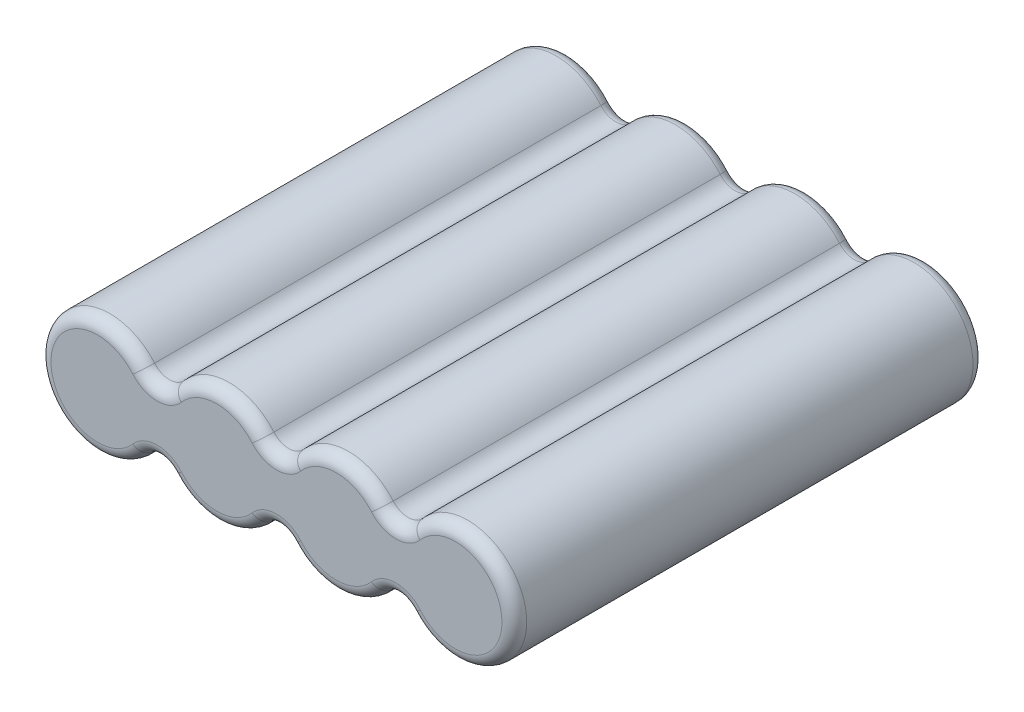
ISO-10303-21;
HEADER;
FILE_DESCRIPTION(('STEP AP214'),'2;1');
FILE_NAME('part.step','',(''),(''),'','','');
FILE_SCHEMA(('AUTOMOTIVE_DESIGN { 1 0 10303 214 1 1 1 1 }'));
ENDSEC;
DATA;
#1=APPLICATION_CONTEXT('core data for automotive mechanical design processes');
#2=APPLICATION_PROTOCOL_DEFINITION('international standard','automotive_design',2000,#1);
#3=PRODUCT_CONTEXT('',#1,'mechanical');
#4=PRODUCT('Part','Part','',(#3));
#5=PRODUCT_RELATED_PRODUCT_CATEGORY('part','',(#4));
#6=PRODUCT_DEFINITION_FORMATION('','',#4);
#7=PRODUCT_DEFINITION_CONTEXT('part definition',#1,'design');
#8=PRODUCT_DEFINITION('design','',#6,#7);
#9=PRODUCT_DEFINITION_SHAPE('','',#8);
#10=(LENGTH_UNIT() NAMED_UNIT(*) SI_UNIT(.MILLI.,.METRE.));
#11=(NAMED_UNIT(*) PLANE_ANGLE_UNIT() SI_UNIT($,.RADIAN.));
#12=(NAMED_UNIT(*) SI_UNIT($,.STERADIAN.) SOLID_ANGLE_UNIT());
#13=UNCERTAINTY_MEASURE_WITH_UNIT(LENGTH_MEASURE(1.E-05),#10,'distance_accuracy_value','');
#14=(GEOMETRIC_REPRESENTATION_CONTEXT(3) GLOBAL_UNCERTAINTY_ASSIGNED_CONTEXT((#13)) GLOBAL_UNIT_ASSIGNED_CONTEXT((#10,
#11,#12)) REPRESENTATION_CONTEXT('',''));
#15=CARTESIAN_POINT('',(0.,0.,0.));
#16=DIRECTION('',(0.,0.,1.));
#17=DIRECTION('',(1.,0.,0.));
#18=AXIS2_PLACEMENT_3D('',#15,#16,#17);
#19=CARTESIAN_POINT('',(9.652,0.,38.1));
#20=DIRECTION('',(0.,0.,-1.));
#21=DIRECTION('',(-1.,0.,0.));
#22=AXIS2_PLACEMENT_3D('',#19,#20,#21);
#23=CYLINDRICAL_SURFACE('',#22,4.7625);
#24=DIRECTION('',(0.,0.,-1.));
#25=VECTOR('',#24,1.);
#26=CARTESIAN_POINT('',(6.0325,3.0952586321663,38.1));
#27=LINE('',#26,#25);
#28=CARTESIAN_POINT('',(6.0325,3.0952586321663,37.1));
#29=VERTEX_POINT('',#28);
#30=CARTESIAN_POINT('',(6.0325,3.0952586321663,1.00000000000001));
#31=VERTEX_POINT('',#30);
#32=EDGE_CURVE('E228',#29,#31,#27,.T.);
#33=ORIENTED_EDGE('',*,*,#32,.F.);
#34=CARTESIAN_POINT('',(9.652,0.,37.1));
#35=DIRECTION('',(0.,0.,1.));
#36=DIRECTION('',(1.,0.,0.));
#37=AXIS2_PLACEMENT_3D('',#34,#35,#36);
#38=CIRCLE('',#37,4.7625);
#39=CARTESIAN_POINT('',(13.2715,3.0952586321663,37.1));
#40=VERTEX_POINT('',#39);
#41=EDGE_CURVE('E245',#29,#40,#38,.F.);
#42=ORIENTED_EDGE('',*,*,#41,.T.);
#43=DIRECTION('',(0.,0.,-1.));
#44=VECTOR('',#43,1.);
#45=CARTESIAN_POINT('',(13.2715,3.0952586321663,38.1));
#46=LINE('',#45,#44);
#47=CARTESIAN_POINT('',(13.2715,3.0952586321663,1.00000000000002));
#48=VERTEX_POINT('',#47);
#49=EDGE_CURVE('E336',#40,#48,#46,.T.);
#50=ORIENTED_EDGE('',*,*,#49,.T.);
#51=CARTESIAN_POINT('',(9.652,0.,0.999999999999994));
#52=DIRECTION('',(0.,0.,1.));
#53=DIRECTION('',(1.,0.,0.));
#54=AXIS2_PLACEMENT_3D('',#51,#52,#53);
#55=CIRCLE('',#54,4.7625);
#56=EDGE_CURVE('E243',#48,#31,#55,.T.);
#57=ORIENTED_EDGE('',*,*,#56,.T.);
#58=EDGE_LOOP('',(#33,#42,#50,#57));
#59=FACE_BOUND('',#58,.T.);
#60=ADVANCED_FACE('F44',(#59),#23,.T.);
#61=CARTESIAN_POINT('',(4.826,4.12701150955507,38.1));
#62=DIRECTION('',(0.,0.,-1.));
#63=DIRECTION('',(-1.,0.,0.));
#64=AXIS2_PLACEMENT_3D('',#61,#62,#63);
#65=CYLINDRICAL_SURFACE('',#64,1.5875);
#66=DIRECTION('',(0.,0.,-1.));
#67=VECTOR('',#66,1.);
#68=CARTESIAN_POINT('',(3.6195,3.0952586321663,38.1));
#69=LINE('',#68,#67);
#70=CARTESIAN_POINT('',(3.6195,3.0952586321663,37.1));
#71=VERTEX_POINT('',#70);
#72=CARTESIAN_POINT('',(3.6195,3.0952586321663,1.00000000000001));
#73=VERTEX_POINT('',#72);
#74=EDGE_CURVE('E431',#71,#73,#69,.T.);
#75=ORIENTED_EDGE('',*,*,#74,.F.);
#76=CARTESIAN_POINT('',(4.826,4.12701150955507,37.1));
#77=DIRECTION('',(0.,0.,1.));
#78=DIRECTION('',(1.,0.,0.));
#79=AXIS2_PLACEMENT_3D('',#76,#77,#78);
#80=CIRCLE('',#79,1.5875);
#81=EDGE_CURVE('E215',#71,#29,#80,.T.);
#82=ORIENTED_EDGE('',*,*,#81,.T.);
#83=ORIENTED_EDGE('',*,*,#32,.T.);
#84=CARTESIAN_POINT('',(4.826,4.12701150955507,1.00000000000001));
#85=DIRECTION('',(0.,0.,1.));
#86=DIRECTION('',(1.,0.,0.));
#87=AXIS2_PLACEMENT_3D('',#84,#85,#86);
#88=CIRCLE('',#87,1.5875);
#89=EDGE_CURVE('E234',#31,#73,#88,.F.);
#90=ORIENTED_EDGE('',*,*,#89,.T.);
#91=EDGE_LOOP('',(#75,#82,#83,#90));
#92=FACE_BOUND('',#91,.T.);
#93=ADVANCED_FACE('F463',(#92),#65,.F.);
#94=CARTESIAN_POINT('',(0.,0.,38.1));
#95=DIRECTION('',(0.,0.,-1.));
#96=DIRECTION('',(-1.,0.,0.));
#97=AXIS2_PLACEMENT_3D('',#94,#95,#96);
#98=CYLINDRICAL_SURFACE('',#97,4.7625);
#99=DIRECTION('',(0.,0.,-1.));
#100=VECTOR('',#99,1.);
#101=CARTESIAN_POINT('',(3.6195,-3.0952586321663,38.1));
#102=LINE('',#101,#100);
#103=CARTESIAN_POINT('',(3.6195,-3.0952586321663,37.1));
#104=VERTEX_POINT('',#103);
#105=CARTESIAN_POINT('',(3.6195,-3.0952586321663,1.00000000000001));
#106=VERTEX_POINT('',#105);
#107=EDGE_CURVE('E428',#104,#106,#102,.T.);
#108=ORIENTED_EDGE('',*,*,#107,.F.);
#109=CARTESIAN_POINT('',(0.,0.,37.1));
#110=DIRECTION('',(0.,0.,1.));
#111=DIRECTION('',(1.,0.,0.));
#112=AXIS2_PLACEMENT_3D('',#109,#110,#111);
#113=CIRCLE('',#112,4.7625);
#114=EDGE_CURVE('E13',#104,#71,#113,.F.);
#115=ORIENTED_EDGE('',*,*,#114,.T.);
#116=ORIENTED_EDGE('',*,*,#74,.T.);
#117=CARTESIAN_POINT('',(0.,0.,0.999999999999994));
#118=DIRECTION('',(0.,0.,1.));
#119=DIRECTION('',(1.,0.,0.));
#120=AXIS2_PLACEMENT_3D('',#117,#118,#119);
#121=CIRCLE('',#120,4.7625);
#122=EDGE_CURVE('E53',#73,#106,#121,.T.);
#123=ORIENTED_EDGE('',*,*,#122,.T.);
#124=EDGE_LOOP('',(#108,#115,#116,#123));
#125=FACE_BOUND('',#124,.T.);
#126=ADVANCED_FACE('F473',(#125),#98,.T.);
#127=CARTESIAN_POINT('',(4.826,-4.12701150955507,38.1));
#128=DIRECTION('',(0.,0.,-1.));
#129=DIRECTION('',(-1.,0.,0.));
#130=AXIS2_PLACEMENT_3D('',#127,#128,#129);
#131=CYLINDRICAL_SURFACE('',#130,1.5875);
#132=DIRECTION('',(0.,0.,-1.));
#133=VECTOR('',#132,1.);
#134=CARTESIAN_POINT('',(6.0325,-3.0952586321663,38.1));
#135=LINE('',#134,#133);
#136=CARTESIAN_POINT('',(6.0325,-3.0952586321663,37.1));
#137=VERTEX_POINT('',#136);
#138=CARTESIAN_POINT('',(6.0325,-3.0952586321663,1.00000000000002));
#139=VERTEX_POINT('',#138);
#140=EDGE_CURVE('E425',#137,#139,#135,.T.);
#141=ORIENTED_EDGE('',*,*,#140,.F.);
#142=CARTESIAN_POINT('',(4.826,-4.12701150955507,37.1));
#143=DIRECTION('',(0.,0.,1.));
#144=DIRECTION('',(1.,0.,0.));
#145=AXIS2_PLACEMENT_3D('',#142,#143,#144);
#146=CIRCLE('',#145,1.5875);
#147=EDGE_CURVE('E281',#137,#104,#146,.T.);
#148=ORIENTED_EDGE('',*,*,#147,.T.);
#149=ORIENTED_EDGE('',*,*,#107,.T.);
#150=CARTESIAN_POINT('',(4.826,-4.12701150955507,1.00000000000001));
#151=DIRECTION('',(0.,0.,1.));
#152=DIRECTION('',(1.,0.,0.));
#153=AXIS2_PLACEMENT_3D('',#150,#151,#152);
#154=CIRCLE('',#153,1.5875);
#155=EDGE_CURVE('E279',#106,#139,#154,.F.);
#156=ORIENTED_EDGE('',*,*,#155,.T.);
#157=EDGE_LOOP('',(#141,#148,#149,#156));
#158=FACE_BOUND('',#157,.T.);
#159=ADVANCED_FACE('F609',(#158),#131,.F.);
#160=CARTESIAN_POINT('',(9.652,0.,38.1));
#161=DIRECTION('',(0.,0.,-1.));
#162=DIRECTION('',(-1.,0.,0.));
#163=AXIS2_PLACEMENT_3D('',#160,#161,#162);
#164=CYLINDRICAL_SURFACE('',#163,4.7625);
#165=DIRECTION('',(0.,0.,-1.));
#166=VECTOR('',#165,1.);
#167=CARTESIAN_POINT('',(13.2715,-3.0952586321663,38.1));
#168=LINE('',#167,#166);
#169=CARTESIAN_POINT('',(13.2715,-3.0952586321663,37.1));
#170=VERTEX_POINT('',#169);
#171=CARTESIAN_POINT('',(13.2715,-3.0952586321663,1.00000000000001));
#172=VERTEX_POINT('',#171);
#173=EDGE_CURVE('E422',#170,#172,#168,.T.);
#174=ORIENTED_EDGE('',*,*,#173,.F.);
#175=CARTESIAN_POINT('',(9.652,0.,37.1));
#176=DIRECTION('',(0.,0.,1.));
#177=DIRECTION('',(1.,0.,0.));
#178=AXIS2_PLACEMENT_3D('',#175,#176,#177);
#179=CIRCLE('',#178,4.7625);
#180=EDGE_CURVE('E277',#170,#137,#179,.F.);
#181=ORIENTED_EDGE('',*,*,#180,.T.);
#182=ORIENTED_EDGE('',*,*,#140,.T.);
#183=CARTESIAN_POINT('',(9.652,0.,0.999999999999994));
#184=DIRECTION('',(0.,0.,1.));
#185=DIRECTION('',(1.,0.,0.));
#186=AXIS2_PLACEMENT_3D('',#183,#184,#185);
#187=CIRCLE('',#186,4.7625);
#188=EDGE_CURVE('E275',#139,#172,#187,.T.);
#189=ORIENTED_EDGE('',*,*,#188,.T.);
#190=EDGE_LOOP('',(#174,#181,#182,#189));
#191=FACE_BOUND('',#190,.T.);
#192=ADVANCED_FACE('F605',(#191),#164,.T.);
#193=CARTESIAN_POINT('',(14.478,-4.12701150955507,38.1));
#194=DIRECTION('',(0.,0.,-1.));
#195=DIRECTION('',(-1.,0.,0.));
#196=AXIS2_PLACEMENT_3D('',#193,#194,#195);
#197=CYLINDRICAL_SURFACE('',#196,1.5875);
#198=DIRECTION('',(0.,0.,-1.));
#199=VECTOR('',#198,1.);
#200=CARTESIAN_POINT('',(15.6845,-3.0952586321663,38.1));
#201=LINE('',#200,#199);
#202=CARTESIAN_POINT('',(15.6845,-3.0952586321663,37.1));
#203=VERTEX_POINT('',#202);
#204=CARTESIAN_POINT('',(15.6845,-3.0952586321663,1.00000000000002));
#205=VERTEX_POINT('',#204);
#206=EDGE_CURVE('E419',#203,#205,#201,.T.);
#207=ORIENTED_EDGE('',*,*,#206,.F.);
#208=CARTESIAN_POINT('',(14.478,-4.12701150955507,37.1));
#209=DIRECTION('',(0.,0.,1.));
#210=DIRECTION('',(1.,0.,0.));
#211=AXIS2_PLACEMENT_3D('',#208,#209,#210);
#212=CIRCLE('',#211,1.5875);
#213=EDGE_CURVE('E273',#203,#170,#212,.T.);
#214=ORIENTED_EDGE('',*,*,#213,.T.);
#215=ORIENTED_EDGE('',*,*,#173,.T.);
#216=CARTESIAN_POINT('',(14.478,-4.12701150955507,1.00000000000001));
#217=DIRECTION('',(0.,0.,1.));
#218=DIRECTION('',(1.,0.,0.));
#219=AXIS2_PLACEMENT_3D('',#216,#217,#218);
#220=CIRCLE('',#219,1.5875);
#221=EDGE_CURVE('E271',#172,#205,#220,.F.);
#222=ORIENTED_EDGE('',*,*,#221,.T.);
#223=EDGE_LOOP('',(#207,#214,#215,#222));
#224=FACE_BOUND('',#223,.T.);
#225=ADVANCED_FACE('F602',(#224),#197,.F.);
#226=CARTESIAN_POINT('',(19.304,0.,38.1));
#227=DIRECTION('',(0.,0.,-1.));
#228=DIRECTION('',(-1.,0.,0.));
#229=AXIS2_PLACEMENT_3D('',#226,#227,#228);
#230=CYLINDRICAL_SURFACE('',#229,4.7625);
#231=DIRECTION('',(0.,0.,-1.));
#232=VECTOR('',#231,1.);
#233=CARTESIAN_POINT('',(22.9235,-3.0952586321663,38.1));
#234=LINE('',#233,#232);
#235=CARTESIAN_POINT('',(22.9235,-3.0952586321663,37.1));
#236=VERTEX_POINT('',#235);
#237=CARTESIAN_POINT('',(22.9235,-3.0952586321663,1.00000000000001));
#238=VERTEX_POINT('',#237);
#239=EDGE_CURVE('E416',#236,#238,#234,.T.);
#240=ORIENTED_EDGE('',*,*,#239,.F.);
#241=CARTESIAN_POINT('',(19.304,0.,37.1));
#242=DIRECTION('',(0.,0.,1.));
#243=DIRECTION('',(1.,0.,0.));
#244=AXIS2_PLACEMENT_3D('',#241,#242,#243);
#245=CIRCLE('',#244,4.7625);
#246=EDGE_CURVE('E269',#236,#203,#245,.F.);
#247=ORIENTED_EDGE('',*,*,#246,.T.);
#248=ORIENTED_EDGE('',*,*,#206,.T.);
#249=CARTESIAN_POINT('',(19.304,0.,0.999999999999994));
#250=DIRECTION('',(0.,0.,1.));
#251=DIRECTION('',(1.,0.,0.));
#252=AXIS2_PLACEMENT_3D('',#249,#250,#251);
#253=CIRCLE('',#252,4.7625);
#254=EDGE_CURVE('E267',#205,#238,#253,.T.);
#255=ORIENTED_EDGE('',*,*,#254,.T.);
#256=EDGE_LOOP('',(#240,#247,#248,#255));
#257=FACE_BOUND('',#256,.T.);
#258=ADVANCED_FACE('F522',(#257),#230,.T.);
#259=CARTESIAN_POINT('',(24.13,-4.12701150955507,38.1));
#260=DIRECTION('',(0.,0.,-1.));
#261=DIRECTION('',(-1.,0.,0.));
#262=AXIS2_PLACEMENT_3D('',#259,#260,#261);
#263=CYLINDRICAL_SURFACE('',#262,1.5875);
#264=DIRECTION('',(0.,0.,-1.));
#265=VECTOR('',#264,1.);
#266=CARTESIAN_POINT('',(25.3365,-3.0952586321663,38.1));
#267=LINE('',#266,#265);
#268=CARTESIAN_POINT('',(25.3365,-3.0952586321663,37.1));
#269=VERTEX_POINT('',#268);
#270=CARTESIAN_POINT('',(25.3365,-3.0952586321663,1.00000000000002));
#271=VERTEX_POINT('',#270);
#272=EDGE_CURVE('E413',#269,#271,#267,.T.);
#273=ORIENTED_EDGE('',*,*,#272,.F.);
#274=CARTESIAN_POINT('',(24.13,-4.12701150955507,37.1));
#275=DIRECTION('',(0.,0.,1.));
#276=DIRECTION('',(1.,0.,0.));
#277=AXIS2_PLACEMENT_3D('',#274,#275,#276);
#278=CIRCLE('',#277,1.5875);
#279=EDGE_CURVE('E265',#269,#236,#278,.T.);
#280=ORIENTED_EDGE('',*,*,#279,.T.);
#281=ORIENTED_EDGE('',*,*,#239,.T.);
#282=CARTESIAN_POINT('',(24.13,-4.12701150955507,1.00000000000001));
#283=DIRECTION('',(0.,0.,1.));
#284=DIRECTION('',(1.,0.,0.));
#285=AXIS2_PLACEMENT_3D('',#282,#283,#284);
#286=CIRCLE('',#285,1.5875);
#287=EDGE_CURVE('E263',#238,#271,#286,.F.);
#288=ORIENTED_EDGE('',*,*,#287,.T.);
#289=EDGE_LOOP('',(#273,#280,#281,#288));
#290=FACE_BOUND('',#289,.T.);
#291=ADVANCED_FACE('F519',(#290),#263,.F.);
#292=CARTESIAN_POINT('',(28.956,0.,38.1));
#293=DIRECTION('',(0.,0.,-1.));
#294=DIRECTION('',(-1.,0.,0.));
#295=AXIS2_PLACEMENT_3D('',#292,#293,#294);
#296=CYLINDRICAL_SURFACE('',#295,4.7625);
#297=DIRECTION('',(0.,0.,-1.));
#298=VECTOR('',#297,1.);
#299=CARTESIAN_POINT('',(25.3365,3.0952586321663,38.1));
#300=LINE('',#299,#298);
#301=CARTESIAN_POINT('',(25.3365,3.0952586321663,37.1));
#302=VERTEX_POINT('',#301);
#303=CARTESIAN_POINT('',(25.3365,3.0952586321663,1.00000000000001));
#304=VERTEX_POINT('',#303);
#305=EDGE_CURVE('E407',#302,#304,#300,.T.);
#306=ORIENTED_EDGE('',*,*,#305,.F.);
#307=CARTESIAN_POINT('',(28.956,0.,37.1));
#308=DIRECTION('',(0.,0.,1.));
#309=DIRECTION('',(1.,0.,0.));
#310=AXIS2_PLACEMENT_3D('',#307,#308,#309);
#311=CIRCLE('',#310,4.7625);
#312=EDGE_CURVE('E261',#302,#269,#311,.F.);
#313=ORIENTED_EDGE('',*,*,#312,.T.);
#314=ORIENTED_EDGE('',*,*,#272,.T.);
#315=CARTESIAN_POINT('',(28.956,0.,0.999999999999994));
#316=DIRECTION('',(0.,0.,1.));
#317=DIRECTION('',(1.,0.,0.));
#318=AXIS2_PLACEMENT_3D('',#315,#316,#317);
#319=CIRCLE('',#318,4.7625);
#320=EDGE_CURVE('E259',#271,#304,#319,.T.);
#321=ORIENTED_EDGE('',*,*,#320,.T.);
#322=EDGE_LOOP('',(#306,#313,#314,#321));
#323=FACE_BOUND('',#322,.T.);
#324=ADVANCED_FACE('F516',(#323),#296,.T.);
#325=CARTESIAN_POINT('',(24.13,4.12701150955507,38.1));
#326=DIRECTION('',(0.,0.,-1.));
#327=DIRECTION('',(-1.,0.,0.));
#328=AXIS2_PLACEMENT_3D('',#325,#326,#327);
#329=CYLINDRICAL_SURFACE('',#328,1.5875);
#330=DIRECTION('',(0.,0.,-1.));
#331=VECTOR('',#330,1.);
#332=CARTESIAN_POINT('',(22.9235,3.0952586321663,38.1));
#333=LINE('',#332,#331);
#334=CARTESIAN_POINT('',(22.9235,3.0952586321663,37.1));
#335=VERTEX_POINT('',#334);
#336=CARTESIAN_POINT('',(22.9235,3.0952586321663,1.00000000000002));
#337=VERTEX_POINT('',#336);
#338=EDGE_CURVE('E400',#335,#337,#333,.T.);
#339=ORIENTED_EDGE('',*,*,#338,.F.);
#340=CARTESIAN_POINT('',(24.13,4.12701150955507,37.1));
#341=DIRECTION('',(0.,0.,1.));
#342=DIRECTION('',(1.,0.,0.));
#343=AXIS2_PLACEMENT_3D('',#340,#341,#342);
#344=CIRCLE('',#343,1.5875);
#345=EDGE_CURVE('E257',#335,#302,#344,.T.);
#346=ORIENTED_EDGE('',*,*,#345,.T.);
#347=ORIENTED_EDGE('',*,*,#305,.T.);
#348=CARTESIAN_POINT('',(24.13,4.12701150955507,1.00000000000001));
#349=DIRECTION('',(0.,0.,1.));
#350=DIRECTION('',(1.,0.,0.));
#351=AXIS2_PLACEMENT_3D('',#348,#349,#350);
#352=CIRCLE('',#351,1.5875);
#353=EDGE_CURVE('E255',#304,#337,#352,.F.);
#354=ORIENTED_EDGE('',*,*,#353,.T.);
#355=EDGE_LOOP('',(#339,#346,#347,#354));
#356=FACE_BOUND('',#355,.T.);
#357=ADVANCED_FACE('F513',(#356),#329,.F.);
#358=CARTESIAN_POINT('',(19.304,0.,38.1));
#359=DIRECTION('',(0.,0.,-1.));
#360=DIRECTION('',(-1.,0.,0.));
#361=AXIS2_PLACEMENT_3D('',#358,#359,#360);
#362=CYLINDRICAL_SURFACE('',#361,4.7625);
#363=DIRECTION('',(0.,0.,-1.));
#364=VECTOR('',#363,1.);
#365=CARTESIAN_POINT('',(15.6845,3.0952586321663,38.1));
#366=LINE('',#365,#364);
#367=CARTESIAN_POINT('',(15.6845,3.0952586321663,37.1));
#368=VERTEX_POINT('',#367);
#369=CARTESIAN_POINT('',(15.6845,3.0952586321663,1.00000000000001));
#370=VERTEX_POINT('',#369);
#371=EDGE_CURVE('E397',#368,#370,#366,.T.);
#372=ORIENTED_EDGE('',*,*,#371,.F.);
#373=CARTESIAN_POINT('',(19.304,0.,37.1));
#374=DIRECTION('',(0.,0.,1.));
#375=DIRECTION('',(1.,0.,0.));
#376=AXIS2_PLACEMENT_3D('',#373,#374,#375);
#377=CIRCLE('',#376,4.7625);
#378=EDGE_CURVE('E253',#368,#335,#377,.F.);
#379=ORIENTED_EDGE('',*,*,#378,.T.);
#380=ORIENTED_EDGE('',*,*,#338,.T.);
#381=CARTESIAN_POINT('',(19.304,0.,0.999999999999994));
#382=DIRECTION('',(0.,0.,1.));
#383=DIRECTION('',(1.,0.,0.));
#384=AXIS2_PLACEMENT_3D('',#381,#382,#383);
#385=CIRCLE('',#384,4.7625);
#386=EDGE_CURVE('E251',#337,#370,#385,.T.);
#387=ORIENTED_EDGE('',*,*,#386,.T.);
#388=EDGE_LOOP('',(#372,#379,#380,#387));
#389=FACE_BOUND('',#388,.T.);
#390=ADVANCED_FACE('F396',(#389),#362,.T.);
#391=CARTESIAN_POINT('',(14.478,4.12701150955507,38.1));
#392=DIRECTION('',(0.,0.,-1.));
#393=DIRECTION('',(-1.,0.,0.));
#394=AXIS2_PLACEMENT_3D('',#391,#392,#393);
#395=CYLINDRICAL_SURFACE('',#394,1.5875);
#396=ORIENTED_EDGE('',*,*,#49,.F.);
#397=CARTESIAN_POINT('',(14.478,4.12701150955507,37.1));
#398=DIRECTION('',(0.,0.,1.));
#399=DIRECTION('',(1.,0.,0.));
#400=AXIS2_PLACEMENT_3D('',#397,#398,#399);
#401=CIRCLE('',#400,1.5875);
#402=EDGE_CURVE('E249',#40,#368,#401,.T.);
#403=ORIENTED_EDGE('',*,*,#402,.T.);
#404=ORIENTED_EDGE('',*,*,#371,.T.);
#405=CARTESIAN_POINT('',(14.478,4.12701150955507,1.00000000000001));
#406=DIRECTION('',(0.,0.,1.));
#407=DIRECTION('',(1.,0.,0.));
#408=AXIS2_PLACEMENT_3D('',#405,#406,#407);
#409=CIRCLE('',#408,1.5875);
#410=EDGE_CURVE('E247',#370,#48,#409,.F.);
#411=ORIENTED_EDGE('',*,*,#410,.T.);
#412=EDGE_LOOP('',(#396,#403,#404,#411));
#413=FACE_BOUND('',#412,.T.);
#414=ADVANCED_FACE('F403',(#413),#395,.F.);
#415=CARTESIAN_POINT('',(7.239,2.06350575477753,38.1));
#416=DIRECTION('',(0.,0.,1.));
#417=DIRECTION('',(1.,0.,0.));
#418=AXIS2_PLACEMENT_3D('',#415,#416,#417);
#419=PLANE('',#418);
#420=CARTESIAN_POINT('',(9.652,0.,38.1));
#421=DIRECTION('',(0.,0.,1.));
#422=DIRECTION('',(1.,0.,0.));
#423=AXIS2_PLACEMENT_3D('',#420,#421,#422);
#424=CIRCLE('',#423,3.7625);
#425=CARTESIAN_POINT('',(12.5115,2.44533555979542,38.1));
#426=VERTEX_POINT('',#425);
#427=CARTESIAN_POINT('',(6.7925,2.44533555979542,38.1));
#428=VERTEX_POINT('',#427);
#429=EDGE_CURVE('E232',#426,#428,#424,.T.);
#430=ORIENTED_EDGE('',*,*,#429,.T.);
#431=CARTESIAN_POINT('',(4.826,4.12701150955507,38.1));
#432=DIRECTION('',(0.,0.,1.));
#433=DIRECTION('',(1.,0.,0.));
#434=AXIS2_PLACEMENT_3D('',#431,#432,#433);
#435=CIRCLE('',#434,2.5875);
#436=CARTESIAN_POINT('',(2.8595,2.44533555979542,38.1));
#437=VERTEX_POINT('',#436);
#438=EDGE_CURVE('E213',#428,#437,#435,.F.);
#439=ORIENTED_EDGE('',*,*,#438,.T.);
#440=CARTESIAN_POINT('',(0.,0.,38.1));
#441=DIRECTION('',(0.,0.,1.));
#442=DIRECTION('',(1.,0.,0.));
#443=AXIS2_PLACEMENT_3D('',#440,#441,#442);
#444=CIRCLE('',#443,3.7625);
#445=CARTESIAN_POINT('',(2.8595,-2.44533555979543,38.1));
#446=VERTEX_POINT('',#445);
#447=EDGE_CURVE('E221',#437,#446,#444,.T.);
#448=ORIENTED_EDGE('',*,*,#447,.T.);
#449=CARTESIAN_POINT('',(4.826,-4.12701150955507,38.1));
#450=DIRECTION('',(0.,0.,1.));
#451=DIRECTION('',(1.,0.,0.));
#452=AXIS2_PLACEMENT_3D('',#449,#450,#451);
#453=CIRCLE('',#452,2.5875);
#454=CARTESIAN_POINT('',(6.7925,-2.44533555979542,38.1));
#455=VERTEX_POINT('',#454);
#456=EDGE_CURVE('E227',#446,#455,#453,.F.);
#457=ORIENTED_EDGE('',*,*,#456,.T.);
#458=CARTESIAN_POINT('',(9.652,0.,38.1));
#459=DIRECTION('',(0.,0.,1.));
#460=DIRECTION('',(1.,0.,0.));
#461=AXIS2_PLACEMENT_3D('',#458,#459,#460);
#462=CIRCLE('',#461,3.7625);
#463=CARTESIAN_POINT('',(12.5115,-2.44533555979543,38.1));
#464=VERTEX_POINT('',#463);
#465=EDGE_CURVE('E437',#455,#464,#462,.T.);
#466=ORIENTED_EDGE('',*,*,#465,.T.);
#467=CARTESIAN_POINT('',(14.478,-4.12701150955507,38.1));
#468=DIRECTION('',(0.,0.,1.));
#469=DIRECTION('',(1.,0.,0.));
#470=AXIS2_PLACEMENT_3D('',#467,#468,#469);
#471=CIRCLE('',#470,2.5875);
#472=CARTESIAN_POINT('',(16.4445,-2.44533555979542,38.1));
#473=VERTEX_POINT('',#472);
#474=EDGE_CURVE('E439',#464,#473,#471,.F.);
#475=ORIENTED_EDGE('',*,*,#474,.T.);
#476=CARTESIAN_POINT('',(19.304,0.,38.1));
#477=DIRECTION('',(0.,0.,1.));
#478=DIRECTION('',(1.,0.,0.));
#479=AXIS2_PLACEMENT_3D('',#476,#477,#478);
#480=CIRCLE('',#479,3.7625);
#481=CARTESIAN_POINT('',(22.1635,-2.44533555979542,38.1));
#482=VERTEX_POINT('',#481);
#483=EDGE_CURVE('E441',#473,#482,#480,.T.);
#484=ORIENTED_EDGE('',*,*,#483,.T.);
#485=CARTESIAN_POINT('',(24.13,-4.12701150955507,38.1));
#486=DIRECTION('',(0.,0.,1.));
#487=DIRECTION('',(1.,0.,0.));
#488=AXIS2_PLACEMENT_3D('',#485,#486,#487);
#489=CIRCLE('',#488,2.5875);
#490=CARTESIAN_POINT('',(26.0965,-2.44533555979542,38.1));
#491=VERTEX_POINT('',#490);
#492=EDGE_CURVE('E443',#482,#491,#489,.F.);
#493=ORIENTED_EDGE('',*,*,#492,.T.);
#494=CARTESIAN_POINT('',(28.956,0.,38.1));
#495=DIRECTION('',(0.,0.,1.));
#496=DIRECTION('',(1.,0.,0.));
#497=AXIS2_PLACEMENT_3D('',#494,#495,#496);
#498=CIRCLE('',#497,3.7625);
#499=CARTESIAN_POINT('',(26.0965,2.44533555979543,38.1));
#500=VERTEX_POINT('',#499);
#501=EDGE_CURVE('E445',#491,#500,#498,.T.);
#502=ORIENTED_EDGE('',*,*,#501,.T.);
#503=CARTESIAN_POINT('',(24.13,4.12701150955507,38.1));
#504=DIRECTION('',(0.,0.,1.));
#505=DIRECTION('',(1.,0.,0.));
#506=AXIS2_PLACEMENT_3D('',#503,#504,#505);
#507=CIRCLE('',#506,2.5875);
#508=CARTESIAN_POINT('',(22.1635,2.44533555979542,38.1));
#509=VERTEX_POINT('',#508);
#510=EDGE_CURVE('E447',#500,#509,#507,.F.);
#511=ORIENTED_EDGE('',*,*,#510,.T.);
#512=CARTESIAN_POINT('',(19.304,0.,38.1));
#513=DIRECTION('',(0.,0.,1.));
#514=DIRECTION('',(1.,0.,0.));
#515=AXIS2_PLACEMENT_3D('',#512,#513,#514);
#516=CIRCLE('',#515,3.7625);
#517=CARTESIAN_POINT('',(16.4445,2.44533555979542,38.1));
#518=VERTEX_POINT('',#517);
#519=EDGE_CURVE('E449',#509,#518,#516,.T.);
#520=ORIENTED_EDGE('',*,*,#519,.T.);
#521=CARTESIAN_POINT('',(14.478,4.12701150955507,38.1));
#522=DIRECTION('',(0.,0.,1.));
#523=DIRECTION('',(1.,0.,0.));
#524=AXIS2_PLACEMENT_3D('',#521,#522,#523);
#525=CIRCLE('',#524,2.5875);
#526=EDGE_CURVE('E238',#518,#426,#525,.F.);
#527=ORIENTED_EDGE('',*,*,#526,.T.);
#528=EDGE_LOOP('',(#430,#439,#448,#457,#466,#475,#484,#493,#502,#511,#520,#527));
#529=FACE_BOUND('',#528,.T.);
#530=ADVANCED_FACE('F230',(#529),#419,.T.);
#531=CARTESIAN_POINT('',(7.239,2.06350575477753,0.));
#532=DIRECTION('',(0.,0.,1.));
#533=DIRECTION('',(1.,0.,0.));
#534=AXIS2_PLACEMENT_3D('',#531,#532,#533);
#535=PLANE('',#534);
#536=CARTESIAN_POINT('',(0.,0.,0.));
#537=DIRECTION('',(0.,0.,1.));
#538=DIRECTION('',(1.,0.,0.));
#539=AXIS2_PLACEMENT_3D('',#536,#537,#538);
#540=CIRCLE('',#539,3.7625);
#541=CARTESIAN_POINT('',(2.8595,-2.44533555979543,0.));
#542=VERTEX_POINT('',#541);
#543=CARTESIAN_POINT('',(2.8595,2.44533555979542,0.));
#544=VERTEX_POINT('',#543);
#545=EDGE_CURVE('E283',#542,#544,#540,.F.);
#546=ORIENTED_EDGE('',*,*,#545,.T.);
#547=CARTESIAN_POINT('',(4.826,4.12701150955507,0.));
#548=DIRECTION('',(0.,0.,1.));
#549=DIRECTION('',(1.,0.,0.));
#550=AXIS2_PLACEMENT_3D('',#547,#548,#549);
#551=CIRCLE('',#550,2.5875);
#552=CARTESIAN_POINT('',(6.7925,2.44533555979542,0.));
#553=VERTEX_POINT('',#552);
#554=EDGE_CURVE('E304',#544,#553,#551,.T.);
#555=ORIENTED_EDGE('',*,*,#554,.T.);
#556=CARTESIAN_POINT('',(9.652,0.,0.));
#557=DIRECTION('',(0.,0.,1.));
#558=DIRECTION('',(1.,0.,0.));
#559=AXIS2_PLACEMENT_3D('',#556,#557,#558);
#560=CIRCLE('',#559,3.7625);
#561=CARTESIAN_POINT('',(12.5115,2.44533555979542,0.));
#562=VERTEX_POINT('',#561);
#563=EDGE_CURVE('E68',#553,#562,#560,.F.);
#564=ORIENTED_EDGE('',*,*,#563,.T.);
#565=CARTESIAN_POINT('',(14.478,4.12701150955507,0.));
#566=DIRECTION('',(0.,0.,1.));
#567=DIRECTION('',(1.,0.,0.));
#568=AXIS2_PLACEMENT_3D('',#565,#566,#567);
#569=CIRCLE('',#568,2.5875);
#570=CARTESIAN_POINT('',(16.4445,2.44533555979542,0.));
#571=VERTEX_POINT('',#570);
#572=EDGE_CURVE('E301',#562,#571,#569,.T.);
#573=ORIENTED_EDGE('',*,*,#572,.T.);
#574=CARTESIAN_POINT('',(19.304,0.,0.));
#575=DIRECTION('',(0.,0.,1.));
#576=DIRECTION('',(1.,0.,0.));
#577=AXIS2_PLACEMENT_3D('',#574,#575,#576);
#578=CIRCLE('',#577,3.7625);
#579=CARTESIAN_POINT('',(22.1635,2.44533555979542,0.));
#580=VERTEX_POINT('',#579);
#581=EDGE_CURVE('E299',#571,#580,#578,.F.);
#582=ORIENTED_EDGE('',*,*,#581,.T.);
#583=CARTESIAN_POINT('',(24.13,4.12701150955507,0.));
#584=DIRECTION('',(0.,0.,1.));
#585=DIRECTION('',(1.,0.,0.));
#586=AXIS2_PLACEMENT_3D('',#583,#584,#585);
#587=CIRCLE('',#586,2.5875);
#588=CARTESIAN_POINT('',(26.0965,2.44533555979543,0.));
#589=VERTEX_POINT('',#588);
#590=EDGE_CURVE('E297',#580,#589,#587,.T.);
#591=ORIENTED_EDGE('',*,*,#590,.T.);
#592=CARTESIAN_POINT('',(28.956,0.,0.));
#593=DIRECTION('',(0.,0.,1.));
#594=DIRECTION('',(1.,0.,0.));
#595=AXIS2_PLACEMENT_3D('',#592,#593,#594);
#596=CIRCLE('',#595,3.7625);
#597=CARTESIAN_POINT('',(26.0965,-2.44533555979542,0.));
#598=VERTEX_POINT('',#597);
#599=EDGE_CURVE('E295',#589,#598,#596,.F.);
#600=ORIENTED_EDGE('',*,*,#599,.T.);
#601=CARTESIAN_POINT('',(24.13,-4.12701150955507,0.));
#602=DIRECTION('',(0.,0.,1.));
#603=DIRECTION('',(1.,0.,0.));
#604=AXIS2_PLACEMENT_3D('',#601,#602,#603);
#605=CIRCLE('',#604,2.5875);
#606=CARTESIAN_POINT('',(22.1635,-2.44533555979542,0.));
#607=VERTEX_POINT('',#606);
#608=EDGE_CURVE('E293',#598,#607,#605,.T.);
#609=ORIENTED_EDGE('',*,*,#608,.T.);
#610=CARTESIAN_POINT('',(19.304,0.,0.));
#611=DIRECTION('',(0.,0.,1.));
#612=DIRECTION('',(1.,0.,0.));
#613=AXIS2_PLACEMENT_3D('',#610,#611,#612);
#614=CIRCLE('',#613,3.7625);
#615=CARTESIAN_POINT('',(16.4445,-2.44533555979542,0.));
#616=VERTEX_POINT('',#615);
#617=EDGE_CURVE('E291',#607,#616,#614,.F.);
#618=ORIENTED_EDGE('',*,*,#617,.T.);
#619=CARTESIAN_POINT('',(14.478,-4.12701150955507,0.));
#620=DIRECTION('',(0.,0.,1.));
#621=DIRECTION('',(1.,0.,0.));
#622=AXIS2_PLACEMENT_3D('',#619,#620,#621);
#623=CIRCLE('',#622,2.5875);
#624=CARTESIAN_POINT('',(12.5115,-2.44533555979543,0.));
#625=VERTEX_POINT('',#624);
#626=EDGE_CURVE('E289',#616,#625,#623,.T.);
#627=ORIENTED_EDGE('',*,*,#626,.T.);
#628=CARTESIAN_POINT('',(9.652,0.,0.));
#629=DIRECTION('',(0.,0.,1.));
#630=DIRECTION('',(1.,0.,0.));
#631=AXIS2_PLACEMENT_3D('',#628,#629,#630);
#632=CIRCLE('',#631,3.7625);
#633=CARTESIAN_POINT('',(6.7925,-2.44533555979542,0.));
#634=VERTEX_POINT('',#633);
#635=EDGE_CURVE('E287',#625,#634,#632,.F.);
#636=ORIENTED_EDGE('',*,*,#635,.T.);
#637=CARTESIAN_POINT('',(4.826,-4.12701150955507,0.));
#638=DIRECTION('',(0.,0.,1.));
#639=DIRECTION('',(1.,0.,0.));
#640=AXIS2_PLACEMENT_3D('',#637,#638,#639);
#641=CIRCLE('',#640,2.5875);
#642=EDGE_CURVE('E285',#634,#542,#641,.T.);
#643=ORIENTED_EDGE('',*,*,#642,.T.);
#644=EDGE_LOOP('',(#546,#555,#564,#573,#582,#591,#600,#609,#618,#627,#636,#643));
#645=FACE_BOUND('',#644,.T.);
#646=ADVANCED_FACE('F379',(#645),#535,.F.);
#647=CARTESIAN_POINT('',(24.13,-4.12701150955507,37.1));
#648=DIRECTION('',(0.,0.,1.));
#649=DIRECTION('',(1.,0.,0.));
#650=AXIS2_PLACEMENT_3D('',#647,#648,#649);
#651=TOROIDAL_SURFACE('',#650,2.5875,1.);
#652=CARTESIAN_POINT('',(22.1635,-2.44533555979542,37.1));
#653=DIRECTION('',(-0.649923072370877,-0.76,0.));
#654=DIRECTION('',(0.76,-0.649923072370877,0.));
#655=AXIS2_PLACEMENT_3D('',#652,#653,#654);
#656=CIRCLE('',#655,1.);
#657=EDGE_CURVE('E330',#236,#482,#656,.T.);
#658=ORIENTED_EDGE('',*,*,#657,.F.);
#659=ORIENTED_EDGE('',*,*,#279,.F.);
#660=CARTESIAN_POINT('',(26.0965,-2.44533555979542,37.1));
#661=DIRECTION('',(0.649923072370877,-0.76,0.));
#662=DIRECTION('',(0.76,0.649923072370877,0.));
#663=AXIS2_PLACEMENT_3D('',#660,#661,#662);
#664=CIRCLE('',#663,1.);
#665=EDGE_CURVE('E333',#491,#269,#664,.T.);
#666=ORIENTED_EDGE('',*,*,#665,.F.);
#667=ORIENTED_EDGE('',*,*,#492,.F.);
#668=EDGE_LOOP('',(#658,#659,#666,#667));
#669=FACE_BOUND('',#668,.T.);
#670=ADVANCED_FACE('F498',(#669),#651,.T.);
#671=CARTESIAN_POINT('',(28.956,0.,37.1));
#672=DIRECTION('',(0.,0.,1.));
#673=DIRECTION('',(1.,0.,0.));
#674=AXIS2_PLACEMENT_3D('',#671,#672,#673);
#675=TOROIDAL_SURFACE('',#674,3.7625,1.);
#676=ORIENTED_EDGE('',*,*,#665,.T.);
#677=ORIENTED_EDGE('',*,*,#312,.F.);
#678=CARTESIAN_POINT('',(26.0965,2.44533555979543,37.1));
#679=DIRECTION('',(-0.649923072370873,-0.760000000000003,0.));
#680=DIRECTION('',(0.760000000000003,-0.649923072370873,0.));
#681=AXIS2_PLACEMENT_3D('',#678,#679,#680);
#682=CIRCLE('',#681,1.);
#683=EDGE_CURVE('E327',#500,#302,#682,.T.);
#684=ORIENTED_EDGE('',*,*,#683,.F.);
#685=ORIENTED_EDGE('',*,*,#501,.F.);
#686=EDGE_LOOP('',(#676,#677,#684,#685));
#687=FACE_BOUND('',#686,.T.);
#688=ADVANCED_FACE('F506',(#687),#675,.T.);
#689=CARTESIAN_POINT('',(19.304,0.,37.1));
#690=DIRECTION('',(0.,0.,1.));
#691=DIRECTION('',(1.,0.,0.));
#692=AXIS2_PLACEMENT_3D('',#689,#690,#691);
#693=TOROIDAL_SURFACE('',#692,3.7625,1.);
#694=ORIENTED_EDGE('',*,*,#657,.T.);
#695=ORIENTED_EDGE('',*,*,#483,.F.);
#696=CARTESIAN_POINT('',(16.4445,-2.44533555979542,37.1));
#697=DIRECTION('',(-0.649923072370877,0.76,0.));
#698=DIRECTION('',(-0.76,-0.649923072370877,0.));
#699=AXIS2_PLACEMENT_3D('',#696,#697,#698);
#700=CIRCLE('',#699,1.);
#701=EDGE_CURVE('E324',#203,#473,#700,.T.);
#702=ORIENTED_EDGE('',*,*,#701,.F.);
#703=ORIENTED_EDGE('',*,*,#246,.F.);
#704=EDGE_LOOP('',(#694,#695,#702,#703));
#705=FACE_BOUND('',#704,.T.);
#706=ADVANCED_FACE('F493',(#705),#693,.T.);
#707=CARTESIAN_POINT('',(24.13,4.12701150955507,37.1));
#708=DIRECTION('',(0.,0.,1.));
#709=DIRECTION('',(1.,0.,0.));
#710=AXIS2_PLACEMENT_3D('',#707,#708,#709);
#711=TOROIDAL_SURFACE('',#710,2.5875,1.);
#712=ORIENTED_EDGE('',*,*,#683,.T.);
#713=ORIENTED_EDGE('',*,*,#345,.F.);
#714=CARTESIAN_POINT('',(22.1635,2.44533555979542,37.1));
#715=DIRECTION('',(-0.649923072370877,0.76,0.));
#716=DIRECTION('',(-0.76,-0.649923072370877,0.));
#717=AXIS2_PLACEMENT_3D('',#714,#715,#716);
#718=CIRCLE('',#717,1.);
#719=EDGE_CURVE('E321',#509,#335,#718,.T.);
#720=ORIENTED_EDGE('',*,*,#719,.F.);
#721=ORIENTED_EDGE('',*,*,#510,.F.);
#722=EDGE_LOOP('',(#712,#713,#720,#721));
#723=FACE_BOUND('',#722,.T.);
#724=ADVANCED_FACE('F509',(#723),#711,.T.);
#725=CARTESIAN_POINT('',(14.478,-4.12701150955507,37.1));
#726=DIRECTION('',(0.,0.,1.));
#727=DIRECTION('',(1.,0.,0.));
#728=AXIS2_PLACEMENT_3D('',#725,#726,#727);
#729=TOROIDAL_SURFACE('',#728,2.5875,1.);
#730=ORIENTED_EDGE('',*,*,#701,.T.);
#731=ORIENTED_EDGE('',*,*,#474,.F.);
#732=CARTESIAN_POINT('',(12.5115,-2.44533555979543,37.1));
#733=DIRECTION('',(-0.649923072370876,-0.760000000000001,0.));
#734=DIRECTION('',(0.760000000000001,-0.649923072370876,0.));
#735=AXIS2_PLACEMENT_3D('',#732,#733,#734);
#736=CIRCLE('',#735,1.);
#737=EDGE_CURVE('E318',#170,#464,#736,.T.);
#738=ORIENTED_EDGE('',*,*,#737,.F.);
#739=ORIENTED_EDGE('',*,*,#213,.F.);
#740=EDGE_LOOP('',(#730,#731,#738,#739));
#741=FACE_BOUND('',#740,.T.);
#742=ADVANCED_FACE('F488',(#741),#729,.T.);
#743=CARTESIAN_POINT('',(19.304,0.,37.1));
#744=DIRECTION('',(0.,0.,1.));
#745=DIRECTION('',(1.,0.,0.));
#746=AXIS2_PLACEMENT_3D('',#743,#744,#745);
#747=TOROIDAL_SURFACE('',#746,3.7625,1.);
#748=ORIENTED_EDGE('',*,*,#719,.T.);
#749=ORIENTED_EDGE('',*,*,#378,.F.);
#750=CARTESIAN_POINT('',(16.4445,2.44533555979542,37.1));
#751=DIRECTION('',(-0.649923072370877,-0.76,0.));
#752=DIRECTION('',(0.76,-0.649923072370877,0.));
#753=AXIS2_PLACEMENT_3D('',#750,#751,#752);
#754=CIRCLE('',#753,1.);
#755=EDGE_CURVE('E315',#518,#368,#754,.T.);
#756=ORIENTED_EDGE('',*,*,#755,.F.);
#757=ORIENTED_EDGE('',*,*,#519,.F.);
#758=EDGE_LOOP('',(#748,#749,#756,#757));
#759=FACE_BOUND('',#758,.T.);
#760=ADVANCED_FACE('F511',(#759),#747,.T.);
#761=CARTESIAN_POINT('',(9.652,0.,37.1));
#762=DIRECTION('',(0.,0.,1.));
#763=DIRECTION('',(1.,0.,0.));
#764=AXIS2_PLACEMENT_3D('',#761,#762,#763);
#765=TOROIDAL_SURFACE('',#764,3.7625,1.);
#766=ORIENTED_EDGE('',*,*,#737,.T.);
#767=ORIENTED_EDGE('',*,*,#465,.F.);
#768=CARTESIAN_POINT('',(6.7925,-2.44533555979542,37.1));
#769=DIRECTION('',(-0.649923072370877,0.76,0.));
#770=DIRECTION('',(-0.76,-0.649923072370877,0.));
#771=AXIS2_PLACEMENT_3D('',#768,#769,#770);
#772=CIRCLE('',#771,1.);
#773=EDGE_CURVE('E312',#137,#455,#772,.T.);
#774=ORIENTED_EDGE('',*,*,#773,.F.);
#775=ORIENTED_EDGE('',*,*,#180,.F.);
#776=EDGE_LOOP('',(#766,#767,#774,#775));
#777=FACE_BOUND('',#776,.T.);
#778=ADVANCED_FACE('F483',(#777),#765,.T.);
#779=CARTESIAN_POINT('',(14.478,4.12701150955507,37.1));
#780=DIRECTION('',(0.,0.,1.));
#781=DIRECTION('',(1.,0.,0.));
#782=AXIS2_PLACEMENT_3D('',#779,#780,#781);
#783=TOROIDAL_SURFACE('',#782,2.5875,1.);
#784=ORIENTED_EDGE('',*,*,#755,.T.);
#785=ORIENTED_EDGE('',*,*,#402,.F.);
#786=CARTESIAN_POINT('',(12.5115,2.44533555979542,37.1));
#787=DIRECTION('',(-0.649923072370877,0.76,0.));
#788=DIRECTION('',(-0.76,-0.649923072370877,0.));
#789=AXIS2_PLACEMENT_3D('',#786,#787,#788);
#790=CIRCLE('',#789,1.);
#791=EDGE_CURVE('E309',#426,#40,#790,.T.);
#792=ORIENTED_EDGE('',*,*,#791,.F.);
#793=ORIENTED_EDGE('',*,*,#526,.F.);
#794=EDGE_LOOP('',(#784,#785,#792,#793));
#795=FACE_BOUND('',#794,.T.);
#796=ADVANCED_FACE('F455',(#795),#783,.T.);
#797=CARTESIAN_POINT('',(4.826,-4.12701150955507,37.1));
#798=DIRECTION('',(0.,0.,1.));
#799=DIRECTION('',(1.,0.,0.));
#800=AXIS2_PLACEMENT_3D('',#797,#798,#799);
#801=TOROIDAL_SURFACE('',#800,2.5875,1.);
#802=ORIENTED_EDGE('',*,*,#773,.T.);
#803=ORIENTED_EDGE('',*,*,#456,.F.);
#804=CARTESIAN_POINT('',(2.8595,-2.44533555979543,37.1));
#805=DIRECTION('',(-0.649923072370876,-0.760000000000001,0.));
#806=DIRECTION('',(0.760000000000001,-0.649923072370876,0.));
#807=AXIS2_PLACEMENT_3D('',#804,#805,#806);
#808=CIRCLE('',#807,1.);
#809=EDGE_CURVE('E224',#104,#446,#808,.T.);
#810=ORIENTED_EDGE('',*,*,#809,.F.);
#811=ORIENTED_EDGE('',*,*,#147,.F.);
#812=EDGE_LOOP('',(#802,#803,#810,#811));
#813=FACE_BOUND('',#812,.T.);
#814=ADVANCED_FACE('F478',(#813),#801,.T.);
#815=CARTESIAN_POINT('',(9.652,0.,37.1));
#816=DIRECTION('',(0.,0.,1.));
#817=DIRECTION('',(1.,0.,0.));
#818=AXIS2_PLACEMENT_3D('',#815,#816,#817);
#819=TOROIDAL_SURFACE('',#818,3.7625,1.);
#820=ORIENTED_EDGE('',*,*,#791,.T.);
#821=ORIENTED_EDGE('',*,*,#41,.F.);
#822=CARTESIAN_POINT('',(6.7925,2.44533555979542,37.1));
#823=DIRECTION('',(-0.649923072370877,-0.76,0.));
#824=DIRECTION('',(0.76,-0.649923072370877,0.));
#825=AXIS2_PLACEMENT_3D('',#822,#823,#824);
#826=CIRCLE('',#825,1.);
#827=EDGE_CURVE('E218',#428,#29,#826,.T.);
#828=ORIENTED_EDGE('',*,*,#827,.F.);
#829=ORIENTED_EDGE('',*,*,#429,.F.);
#830=EDGE_LOOP('',(#820,#821,#828,#829));
#831=FACE_BOUND('',#830,.T.);
#832=ADVANCED_FACE('F458',(#831),#819,.T.);
#833=CARTESIAN_POINT('',(0.,0.,37.1));
#834=DIRECTION('',(0.,0.,1.));
#835=DIRECTION('',(1.,0.,0.));
#836=AXIS2_PLACEMENT_3D('',#833,#834,#835);
#837=TOROIDAL_SURFACE('',#836,3.7625,1.);
#838=ORIENTED_EDGE('',*,*,#809,.T.);
#839=ORIENTED_EDGE('',*,*,#447,.F.);
#840=CARTESIAN_POINT('',(2.8595,2.44533555979542,37.1));
#841=DIRECTION('',(0.649923072370877,-0.76,0.));
#842=DIRECTION('',(0.76,0.649923072370877,0.));
#843=AXIS2_PLACEMENT_3D('',#840,#841,#842);
#844=CIRCLE('',#843,1.);
#845=EDGE_CURVE('E209',#71,#437,#844,.T.);
#846=ORIENTED_EDGE('',*,*,#845,.F.);
#847=ORIENTED_EDGE('',*,*,#114,.F.);
#848=EDGE_LOOP('',(#838,#839,#846,#847));
#849=FACE_BOUND('',#848,.T.);
#850=ADVANCED_FACE('F222',(#849),#837,.T.);
#851=CARTESIAN_POINT('',(4.826,4.12701150955507,37.1));
#852=DIRECTION('',(0.,0.,1.));
#853=DIRECTION('',(1.,0.,0.));
#854=AXIS2_PLACEMENT_3D('',#851,#852,#853);
#855=TOROIDAL_SURFACE('',#854,2.5875,1.);
#856=ORIENTED_EDGE('',*,*,#827,.T.);
#857=ORIENTED_EDGE('',*,*,#81,.F.);
#858=ORIENTED_EDGE('',*,*,#845,.T.);
#859=ORIENTED_EDGE('',*,*,#438,.F.);
#860=EDGE_LOOP('',(#856,#857,#858,#859));
#861=FACE_BOUND('',#860,.T.);
#862=ADVANCED_FACE('F211',(#861),#855,.T.);
#863=CARTESIAN_POINT('',(24.13,-4.12701150955507,1.));
#864=DIRECTION('',(0.,0.,1.));
#865=DIRECTION('',(1.,0.,0.));
#866=AXIS2_PLACEMENT_3D('',#863,#864,#865);
#867=TOROIDAL_SURFACE('',#866,2.5875,1.);
#868=CARTESIAN_POINT('',(22.1635,-2.44533555979542,1.));
#869=DIRECTION('',(-0.649923072370877,-0.76,0.));
#870=DIRECTION('',(0.76,-0.649923072370877,0.));
#871=AXIS2_PLACEMENT_3D('',#868,#869,#870);
#872=CIRCLE('',#871,1.);
#873=EDGE_CURVE('E363',#607,#238,#872,.T.);
#874=ORIENTED_EDGE('',*,*,#873,.F.);
#875=ORIENTED_EDGE('',*,*,#608,.F.);
#876=CARTESIAN_POINT('',(26.0965,-2.44533555979542,0.999999999999998));
#877=DIRECTION('',(0.649923072370877,-0.76,0.));
#878=DIRECTION('',(0.76,0.649923072370877,0.));
#879=AXIS2_PLACEMENT_3D('',#876,#877,#878);
#880=CIRCLE('',#879,1.);
#881=EDGE_CURVE('E48',#271,#598,#880,.T.);
#882=ORIENTED_EDGE('',*,*,#881,.F.);
#883=ORIENTED_EDGE('',*,*,#287,.F.);
#884=EDGE_LOOP('',(#874,#875,#882,#883));
#885=FACE_BOUND('',#884,.T.);
#886=ADVANCED_FACE('F46',(#885),#867,.T.);
#887=CARTESIAN_POINT('',(28.956,0.,1.));
#888=DIRECTION('',(0.,0.,1.));
#889=DIRECTION('',(1.,0.,0.));
#890=AXIS2_PLACEMENT_3D('',#887,#888,#889);
#891=TOROIDAL_SURFACE('',#890,3.7625,1.);
#892=ORIENTED_EDGE('',*,*,#881,.T.);
#893=ORIENTED_EDGE('',*,*,#599,.F.);
#894=CARTESIAN_POINT('',(26.0965,2.44533555979543,1.));
#895=DIRECTION('',(-0.649923072370877,-0.759999999999999,0.));
#896=DIRECTION('',(0.759999999999999,-0.649923072370877,0.));
#897=AXIS2_PLACEMENT_3D('',#894,#895,#896);
#898=CIRCLE('',#897,1.);
#899=EDGE_CURVE('E361',#304,#589,#898,.T.);
#900=ORIENTED_EDGE('',*,*,#899,.F.);
#901=ORIENTED_EDGE('',*,*,#320,.F.);
#902=EDGE_LOOP('',(#892,#893,#900,#901));
#903=FACE_BOUND('',#902,.T.);
#904=ADVANCED_FACE('F374',(#903),#891,.T.);
#905=CARTESIAN_POINT('',(19.304,0.,1.));
#906=DIRECTION('',(0.,0.,1.));
#907=DIRECTION('',(1.,0.,0.));
#908=AXIS2_PLACEMENT_3D('',#905,#906,#907);
#909=TOROIDAL_SURFACE('',#908,3.7625,1.);
#910=ORIENTED_EDGE('',*,*,#873,.T.);
#911=ORIENTED_EDGE('',*,*,#254,.F.);
#912=CARTESIAN_POINT('',(16.4445,-2.44533555979542,1.));
#913=DIRECTION('',(-0.649923072370877,0.76,0.));
#914=DIRECTION('',(-0.76,-0.649923072370877,0.));
#915=AXIS2_PLACEMENT_3D('',#912,#913,#914);
#916=CIRCLE('',#915,1.);
#917=EDGE_CURVE('E358',#616,#205,#916,.T.);
#918=ORIENTED_EDGE('',*,*,#917,.F.);
#919=ORIENTED_EDGE('',*,*,#617,.F.);
#920=EDGE_LOOP('',(#910,#911,#918,#919));
#921=FACE_BOUND('',#920,.T.);
#922=ADVANCED_FACE('F524',(#921),#909,.T.);
#923=CARTESIAN_POINT('',(24.13,4.12701150955507,1.));
#924=DIRECTION('',(0.,0.,1.));
#925=DIRECTION('',(1.,0.,0.));
#926=AXIS2_PLACEMENT_3D('',#923,#924,#925);
#927=TOROIDAL_SURFACE('',#926,2.5875,1.);
#928=ORIENTED_EDGE('',*,*,#899,.T.);
#929=ORIENTED_EDGE('',*,*,#590,.F.);
#930=CARTESIAN_POINT('',(22.1635,2.44533555979542,0.999999999999998));
#931=DIRECTION('',(-0.649923072370877,0.76,0.));
#932=DIRECTION('',(-0.76,-0.649923072370877,0.));
#933=AXIS2_PLACEMENT_3D('',#930,#931,#932);
#934=CIRCLE('',#933,1.);
#935=EDGE_CURVE('E355',#337,#580,#934,.T.);
#936=ORIENTED_EDGE('',*,*,#935,.F.);
#937=ORIENTED_EDGE('',*,*,#353,.F.);
#938=EDGE_LOOP('',(#928,#929,#936,#937));
#939=FACE_BOUND('',#938,.T.);
#940=ADVANCED_FACE('F385',(#939),#927,.T.);
#941=CARTESIAN_POINT('',(14.478,-4.12701150955507,1.));
#942=DIRECTION('',(0.,0.,1.));
#943=DIRECTION('',(1.,0.,0.));
#944=AXIS2_PLACEMENT_3D('',#941,#942,#943);
#945=TOROIDAL_SURFACE('',#944,2.5875,1.);
#946=ORIENTED_EDGE('',*,*,#917,.T.);
#947=ORIENTED_EDGE('',*,*,#221,.F.);
#948=CARTESIAN_POINT('',(12.5115,-2.44533555979543,1.));
#949=DIRECTION('',(-0.649923072370876,-0.76,0.));
#950=DIRECTION('',(0.760000000000001,-0.649923072370876,0.));
#951=AXIS2_PLACEMENT_3D('',#948,#949,#950);
#952=CIRCLE('',#951,1.);
#953=EDGE_CURVE('E352',#625,#172,#952,.T.);
#954=ORIENTED_EDGE('',*,*,#953,.F.);
#955=ORIENTED_EDGE('',*,*,#626,.F.);
#956=EDGE_LOOP('',(#946,#947,#954,#955));
#957=FACE_BOUND('',#956,.T.);
#958=ADVANCED_FACE('F528',(#957),#945,.T.);
#959=CARTESIAN_POINT('',(19.304,0.,1.));
#960=DIRECTION('',(0.,0.,1.));
#961=DIRECTION('',(1.,0.,0.));
#962=AXIS2_PLACEMENT_3D('',#959,#960,#961);
#963=TOROIDAL_SURFACE('',#962,3.7625,1.);
#964=ORIENTED_EDGE('',*,*,#935,.T.);
#965=ORIENTED_EDGE('',*,*,#581,.F.);
#966=CARTESIAN_POINT('',(16.4445,2.44533555979542,1.));
#967=DIRECTION('',(-0.649923072370877,-0.76,0.));
#968=DIRECTION('',(0.76,-0.649923072370877,0.));
#969=AXIS2_PLACEMENT_3D('',#966,#967,#968);
#970=CIRCLE('',#969,1.);
#971=EDGE_CURVE('E349',#370,#571,#970,.T.);
#972=ORIENTED_EDGE('',*,*,#971,.F.);
#973=ORIENTED_EDGE('',*,*,#386,.F.);
#974=EDGE_LOOP('',(#964,#965,#972,#973));
#975=FACE_BOUND('',#974,.T.);
#976=ADVANCED_FACE('F389',(#975),#963,.T.);
#977=CARTESIAN_POINT('',(9.652,0.,1.));
#978=DIRECTION('',(0.,0.,1.));
#979=DIRECTION('',(1.,0.,0.));
#980=AXIS2_PLACEMENT_3D('',#977,#978,#979);
#981=TOROIDAL_SURFACE('',#980,3.7625,1.);
#982=ORIENTED_EDGE('',*,*,#953,.T.);
#983=ORIENTED_EDGE('',*,*,#188,.F.);
#984=CARTESIAN_POINT('',(6.7925,-2.44533555979542,1.));
#985=DIRECTION('',(-0.649923072370877,0.76,0.));
#986=DIRECTION('',(-0.76,-0.649923072370877,0.));
#987=AXIS2_PLACEMENT_3D('',#984,#985,#986);
#988=CIRCLE('',#987,1.);
#989=EDGE_CURVE('E346',#634,#139,#988,.T.);
#990=ORIENTED_EDGE('',*,*,#989,.F.);
#991=ORIENTED_EDGE('',*,*,#635,.F.);
#992=EDGE_LOOP('',(#982,#983,#990,#991));
#993=FACE_BOUND('',#992,.T.);
#994=ADVANCED_FACE('F536',(#993),#981,.T.);
#995=CARTESIAN_POINT('',(14.478,4.12701150955507,1.));
#996=DIRECTION('',(0.,0.,1.));
#997=DIRECTION('',(1.,0.,0.));
#998=AXIS2_PLACEMENT_3D('',#995,#996,#997);
#999=TOROIDAL_SURFACE('',#998,2.5875,1.);
#1000=ORIENTED_EDGE('',*,*,#971,.T.);
#1001=ORIENTED_EDGE('',*,*,#572,.F.);
#1002=CARTESIAN_POINT('',(12.5115,2.44533555979542,0.999999999999998));
#1003=DIRECTION('',(-0.649923072370877,0.76,0.));
#1004=DIRECTION('',(-0.76,-0.649923072370877,0.));
#1005=AXIS2_PLACEMENT_3D('',#1002,#1003,#1004);
#1006=CIRCLE('',#1005,1.);
#1007=EDGE_CURVE('E343',#48,#562,#1006,.T.);
#1008=ORIENTED_EDGE('',*,*,#1007,.F.);
#1009=ORIENTED_EDGE('',*,*,#410,.F.);
#1010=EDGE_LOOP('',(#1000,#1001,#1008,#1009));
#1011=FACE_BOUND('',#1010,.T.);
#1012=ADVANCED_FACE('F789',(#1011),#999,.T.);
#1013=CARTESIAN_POINT('',(4.826,-4.12701150955507,1.));
#1014=DIRECTION('',(0.,0.,1.));
#1015=DIRECTION('',(1.,0.,0.));
#1016=AXIS2_PLACEMENT_3D('',#1013,#1014,#1015);
#1017=TOROIDAL_SURFACE('',#1016,2.5875,1.);
#1018=ORIENTED_EDGE('',*,*,#989,.T.);
#1019=ORIENTED_EDGE('',*,*,#155,.F.);
#1020=CARTESIAN_POINT('',(2.8595,-2.44533555979543,1.));
#1021=DIRECTION('',(-0.649923072370875,-0.760000000000001,0.));
#1022=DIRECTION('',(0.760000000000001,-0.649923072370876,0.));
#1023=AXIS2_PLACEMENT_3D('',#1020,#1021,#1022);
#1024=CIRCLE('',#1023,1.);
#1025=EDGE_CURVE('E340',#542,#106,#1024,.T.);
#1026=ORIENTED_EDGE('',*,*,#1025,.F.);
#1027=ORIENTED_EDGE('',*,*,#642,.F.);
#1028=EDGE_LOOP('',(#1018,#1019,#1026,#1027));
#1029=FACE_BOUND('',#1028,.T.);
#1030=ADVANCED_FACE('F538',(#1029),#1017,.T.);
#1031=CARTESIAN_POINT('',(9.652,0.,1.));
#1032=DIRECTION('',(0.,0.,1.));
#1033=DIRECTION('',(1.,0.,0.));
#1034=AXIS2_PLACEMENT_3D('',#1031,#1032,#1033);
#1035=TOROIDAL_SURFACE('',#1034,3.7625,1.);
#1036=ORIENTED_EDGE('',*,*,#1007,.T.);
#1037=ORIENTED_EDGE('',*,*,#563,.F.);
#1038=CARTESIAN_POINT('',(6.7925,2.44533555979542,1.));
#1039=DIRECTION('',(-0.649923072370877,-0.76,0.));
#1040=DIRECTION('',(0.76,-0.649923072370877,0.));
#1041=AXIS2_PLACEMENT_3D('',#1038,#1039,#1040);
#1042=CIRCLE('',#1041,1.);
#1043=EDGE_CURVE('E61',#31,#553,#1042,.T.);
#1044=ORIENTED_EDGE('',*,*,#1043,.F.);
#1045=ORIENTED_EDGE('',*,*,#56,.F.);
#1046=EDGE_LOOP('',(#1036,#1037,#1044,#1045));
#1047=FACE_BOUND('',#1046,.T.);
#1048=ADVANCED_FACE('F467',(#1047),#1035,.T.);
#1049=CARTESIAN_POINT('',(0.,0.,1.));
#1050=DIRECTION('',(0.,0.,1.));
#1051=DIRECTION('',(1.,0.,0.));
#1052=AXIS2_PLACEMENT_3D('',#1049,#1050,#1051);
#1053=TOROIDAL_SURFACE('',#1052,3.7625,1.);
#1054=ORIENTED_EDGE('',*,*,#1025,.T.);
#1055=ORIENTED_EDGE('',*,*,#122,.F.);
#1056=CARTESIAN_POINT('',(2.8595,2.44533555979542,1.));
#1057=DIRECTION('',(0.649923072370876,-0.76,0.));
#1058=DIRECTION('',(0.76,0.649923072370877,0.));
#1059=AXIS2_PLACEMENT_3D('',#1056,#1057,#1058);
#1060=CIRCLE('',#1059,1.);
#1061=EDGE_CURVE('E337',#544,#73,#1060,.T.);
#1062=ORIENTED_EDGE('',*,*,#1061,.F.);
#1063=ORIENTED_EDGE('',*,*,#545,.F.);
#1064=EDGE_LOOP('',(#1054,#1055,#1062,#1063));
#1065=FACE_BOUND('',#1064,.T.);
#1066=ADVANCED_FACE('F541',(#1065),#1053,.T.);
#1067=CARTESIAN_POINT('',(4.826,4.12701150955507,1.));
#1068=DIRECTION('',(0.,0.,1.));
#1069=DIRECTION('',(1.,0.,0.));
#1070=AXIS2_PLACEMENT_3D('',#1067,#1068,#1069);
#1071=TOROIDAL_SURFACE('',#1070,2.5875,1.);
#1072=ORIENTED_EDGE('',*,*,#1043,.T.);
#1073=ORIENTED_EDGE('',*,*,#554,.F.);
#1074=ORIENTED_EDGE('',*,*,#1061,.T.);
#1075=ORIENTED_EDGE('',*,*,#89,.F.);
#1076=EDGE_LOOP('',(#1072,#1073,#1074,#1075));
#1077=FACE_BOUND('',#1076,.T.);
#1078=ADVANCED_FACE('F468',(#1077),#1071,.T.);
#1079=CLOSED_SHELL('',(#60,#93,#126,#159,#192,#225,#258,#291,#324,#357,#390,#414,#530,#646,#670,
#688,#706,#724,#742,#760,#778,#796,#814,#832,#850,#862,#886,#904,#922,#940,#958,#976,#994,#1012,
#1030,#1048,#1066,#1078));
#1080=MANIFOLD_SOLID_BREP('B2',#1079);
#1081=ADVANCED_BREP_SHAPE_REPRESENTATION('',(#18,#1080),#14);
#1082=SHAPE_DEFINITION_REPRESENTATION(#9,#1081);
ENDSEC;
END-ISO-10303-21;
